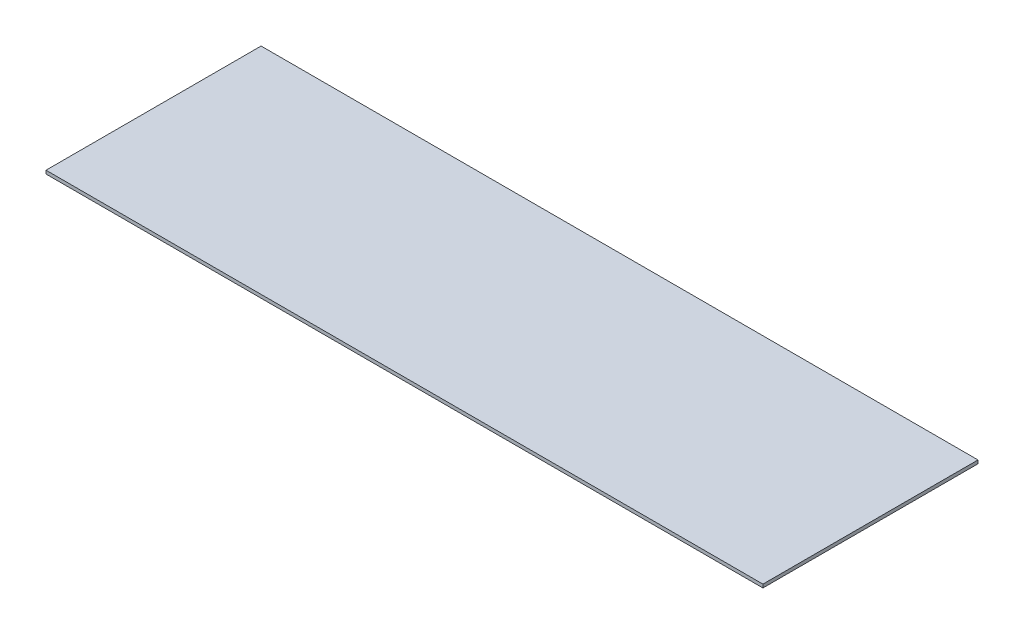
ISO-10303-21;
HEADER;
FILE_DESCRIPTION(('STEP AP214'),'2;1');
FILE_NAME('part.step','',(''),(''),'','','');
FILE_SCHEMA(('AUTOMOTIVE_DESIGN { 1 0 10303 214 1 1 1 1 }'));
ENDSEC;
DATA;
#1=APPLICATION_CONTEXT('core data for automotive mechanical design processes');
#2=APPLICATION_PROTOCOL_DEFINITION('international standard','automotive_design',2000,#1);
#3=PRODUCT_CONTEXT('',#1,'mechanical');
#4=PRODUCT('Part','Part','',(#3));
#5=PRODUCT_RELATED_PRODUCT_CATEGORY('part','',(#4));
#6=PRODUCT_DEFINITION_FORMATION('','',#4);
#7=PRODUCT_DEFINITION_CONTEXT('part definition',#1,'design');
#8=PRODUCT_DEFINITION('design','',#6,#7);
#9=PRODUCT_DEFINITION_SHAPE('','',#8);
#10=(LENGTH_UNIT() NAMED_UNIT(*) SI_UNIT(.MILLI.,.METRE.));
#11=(NAMED_UNIT(*) PLANE_ANGLE_UNIT() SI_UNIT($,.RADIAN.));
#12=(NAMED_UNIT(*) SI_UNIT($,.STERADIAN.) SOLID_ANGLE_UNIT());
#13=UNCERTAINTY_MEASURE_WITH_UNIT(LENGTH_MEASURE(1.E-05),#10,'distance_accuracy_value','');
#14=(GEOMETRIC_REPRESENTATION_CONTEXT(3) GLOBAL_UNCERTAINTY_ASSIGNED_CONTEXT((#13)) GLOBAL_UNIT_ASSIGNED_CONTEXT((#10,
#11,#12)) REPRESENTATION_CONTEXT('',''));
#15=CARTESIAN_POINT('',(0.,0.,0.));
#16=DIRECTION('',(0.,0.,1.));
#17=DIRECTION('',(1.,0.,0.));
#18=AXIS2_PLACEMENT_3D('',#15,#16,#17);
#19=CARTESIAN_POINT('',(0.,4.7625,0.));
#20=DIRECTION('',(0.,1.,0.));
#21=DIRECTION('',(0.,0.,1.));
#22=AXIS2_PLACEMENT_3D('',#19,#20,#21);
#23=PLANE('',#22);
#24=DIRECTION('',(-1.,0.,0.));
#25=VECTOR('',#24,1.);
#26=CARTESIAN_POINT('',(508.,4.7625,-152.4));
#27=LINE('',#26,#25);
#28=CARTESIAN_POINT('',(-508.,4.7625,-152.4));
#29=VERTEX_POINT('',#28);
#30=CARTESIAN_POINT('',(508.,4.7625,-152.4));
#31=VERTEX_POINT('',#30);
#32=EDGE_CURVE('E67',#29,#31,#27,.F.);
#33=ORIENTED_EDGE('',*,*,#32,.F.);
#34=DIRECTION('',(0.,0.,1.));
#35=VECTOR('',#34,1.);
#36=CARTESIAN_POINT('',(-508.,4.7625,-152.4));
#37=LINE('',#36,#35);
#38=CARTESIAN_POINT('',(-508.,4.7625,152.4));
#39=VERTEX_POINT('',#38);
#40=EDGE_CURVE('E19',#39,#29,#37,.F.);
#41=ORIENTED_EDGE('',*,*,#40,.F.);
#42=DIRECTION('',(1.,0.,0.));
#43=VECTOR('',#42,1.);
#44=CARTESIAN_POINT('',(-508.,4.7625,152.4));
#45=LINE('',#44,#43);
#46=CARTESIAN_POINT('',(508.,4.7625,152.4));
#47=VERTEX_POINT('',#46);
#48=EDGE_CURVE('E57',#47,#39,#45,.F.);
#49=ORIENTED_EDGE('',*,*,#48,.F.);
#50=DIRECTION('',(0.,0.,-1.));
#51=VECTOR('',#50,1.);
#52=CARTESIAN_POINT('',(508.,4.7625,152.4));
#53=LINE('',#52,#51);
#54=EDGE_CURVE('E52',#31,#47,#53,.F.);
#55=ORIENTED_EDGE('',*,*,#54,.F.);
#56=EDGE_LOOP('',(#33,#41,#49,#55));
#57=FACE_BOUND('',#56,.T.);
#58=ADVANCED_FACE('F16',(#57),#23,.T.);
#59=CARTESIAN_POINT('',(-508.,0.,-152.4));
#60=DIRECTION('',(-1.,0.,0.));
#61=DIRECTION('',(0.,0.,1.));
#62=AXIS2_PLACEMENT_3D('',#59,#60,#61);
#63=PLANE('',#62);
#64=DIRECTION('',(0.,1.,0.));
#65=VECTOR('',#64,1.);
#66=CARTESIAN_POINT('',(-508.,0.,-152.4));
#67=LINE('',#66,#65);
#68=CARTESIAN_POINT('',(-508.,0.,-152.4));
#69=VERTEX_POINT('',#68);
#70=EDGE_CURVE('E78',#69,#29,#67,.T.);
#71=ORIENTED_EDGE('',*,*,#70,.F.);
#72=DIRECTION('',(0.,0.,1.));
#73=VECTOR('',#72,1.);
#74=CARTESIAN_POINT('',(-508.,0.,0.));
#75=LINE('',#74,#73);
#76=CARTESIAN_POINT('',(-508.,0.,152.4));
#77=VERTEX_POINT('',#76);
#78=EDGE_CURVE('E73',#69,#77,#75,.T.);
#79=ORIENTED_EDGE('',*,*,#78,.T.);
#80=DIRECTION('',(0.,1.,0.));
#81=VECTOR('',#80,1.);
#82=CARTESIAN_POINT('',(-508.,0.,152.4));
#83=LINE('',#82,#81);
#84=EDGE_CURVE('E62',#39,#77,#83,.F.);
#85=ORIENTED_EDGE('',*,*,#84,.F.);
#86=ORIENTED_EDGE('',*,*,#40,.T.);
#87=EDGE_LOOP('',(#71,#79,#85,#86));
#88=FACE_BOUND('',#87,.T.);
#89=ADVANCED_FACE('F72',(#88),#63,.T.);
#90=CARTESIAN_POINT('',(-508.,0.,152.4));
#91=DIRECTION('',(0.,0.,1.));
#92=DIRECTION('',(1.,0.,0.));
#93=AXIS2_PLACEMENT_3D('',#90,#91,#92);
#94=PLANE('',#93);
#95=ORIENTED_EDGE('',*,*,#84,.T.);
#96=DIRECTION('',(1.,0.,0.));
#97=VECTOR('',#96,1.);
#98=CARTESIAN_POINT('',(0.,0.,152.4));
#99=LINE('',#98,#97);
#100=CARTESIAN_POINT('',(508.,0.,152.4));
#101=VERTEX_POINT('',#100);
#102=EDGE_CURVE('E83',#77,#101,#99,.T.);
#103=ORIENTED_EDGE('',*,*,#102,.T.);
#104=DIRECTION('',(0.,1.,0.));
#105=VECTOR('',#104,1.);
#106=CARTESIAN_POINT('',(508.,0.,152.4));
#107=LINE('',#106,#105);
#108=EDGE_CURVE('E64',#47,#101,#107,.F.);
#109=ORIENTED_EDGE('',*,*,#108,.F.);
#110=ORIENTED_EDGE('',*,*,#48,.T.);
#111=EDGE_LOOP('',(#95,#103,#109,#110));
#112=FACE_BOUND('',#111,.T.);
#113=ADVANCED_FACE('F59',(#112),#94,.T.);
#114=CARTESIAN_POINT('',(508.,0.,152.4));
#115=DIRECTION('',(1.,0.,0.));
#116=DIRECTION('',(0.,0.,-1.));
#117=AXIS2_PLACEMENT_3D('',#114,#115,#116);
#118=PLANE('',#117);
#119=ORIENTED_EDGE('',*,*,#108,.T.);
#120=DIRECTION('',(0.,0.,1.));
#121=VECTOR('',#120,1.);
#122=CARTESIAN_POINT('',(508.,0.,0.));
#123=LINE('',#122,#121);
#124=CARTESIAN_POINT('',(508.,0.,-152.4));
#125=VERTEX_POINT('',#124);
#126=EDGE_CURVE('E25',#101,#125,#123,.F.);
#127=ORIENTED_EDGE('',*,*,#126,.T.);
#128=DIRECTION('',(0.,1.,0.));
#129=VECTOR('',#128,1.);
#130=CARTESIAN_POINT('',(508.,0.,-152.4));
#131=LINE('',#130,#129);
#132=EDGE_CURVE('E33',#31,#125,#131,.F.);
#133=ORIENTED_EDGE('',*,*,#132,.F.);
#134=ORIENTED_EDGE('',*,*,#54,.T.);
#135=EDGE_LOOP('',(#119,#127,#133,#134));
#136=FACE_BOUND('',#135,.T.);
#137=ADVANCED_FACE('F87',(#136),#118,.T.);
#138=CARTESIAN_POINT('',(508.,0.,-152.4));
#139=DIRECTION('',(0.,0.,-1.));
#140=DIRECTION('',(-1.,0.,0.));
#141=AXIS2_PLACEMENT_3D('',#138,#139,#140);
#142=PLANE('',#141);
#143=ORIENTED_EDGE('',*,*,#132,.T.);
#144=DIRECTION('',(1.,0.,0.));
#145=VECTOR('',#144,1.);
#146=CARTESIAN_POINT('',(0.,0.,-152.4));
#147=LINE('',#146,#145);
#148=EDGE_CURVE('E11',#125,#69,#147,.F.);
#149=ORIENTED_EDGE('',*,*,#148,.T.);
#150=ORIENTED_EDGE('',*,*,#70,.T.);
#151=ORIENTED_EDGE('',*,*,#32,.T.);
#152=EDGE_LOOP('',(#143,#149,#150,#151));
#153=FACE_BOUND('',#152,.T.);
#154=ADVANCED_FACE('F90',(#153),#142,.T.);
#155=CARTESIAN_POINT('',(0.,0.,0.));
#156=DIRECTION('',(0.,1.,0.));
#157=DIRECTION('',(0.,0.,1.));
#158=AXIS2_PLACEMENT_3D('',#155,#156,#157);
#159=PLANE('',#158);
#160=ORIENTED_EDGE('',*,*,#126,.F.);
#161=ORIENTED_EDGE('',*,*,#102,.F.);
#162=ORIENTED_EDGE('',*,*,#78,.F.);
#163=ORIENTED_EDGE('',*,*,#148,.F.);
#164=EDGE_LOOP('',(#160,#161,#162,#163));
#165=FACE_BOUND('',#164,.T.);
#166=ADVANCED_FACE('F89',(#165),#159,.F.);
#167=CLOSED_SHELL('',(#58,#89,#113,#137,#154,#166));
#168=MANIFOLD_SOLID_BREP('B1',#167);
#169=ADVANCED_BREP_SHAPE_REPRESENTATION('',(#18,#168),#14);
#170=SHAPE_DEFINITION_REPRESENTATION(#9,#169);
ENDSEC;
END-ISO-10303-21;
